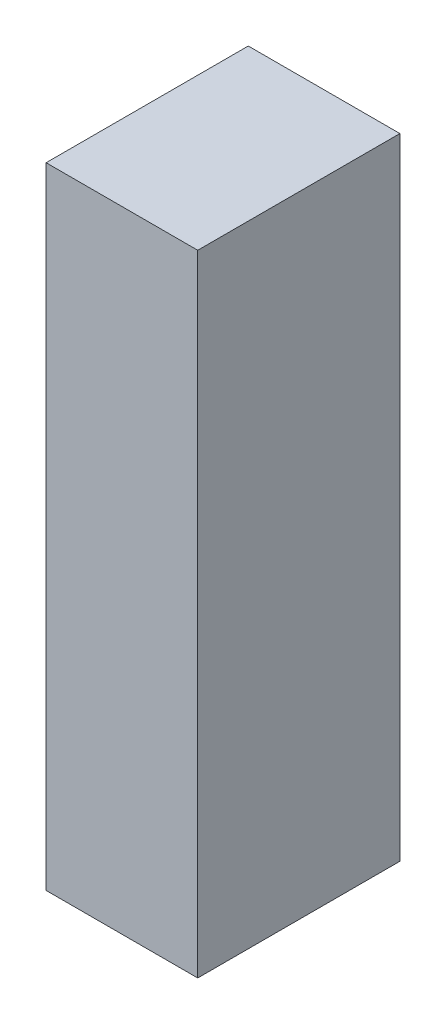
ISO-10303-21;
HEADER;
FILE_DESCRIPTION(('STEP AP214'),'2;1');
FILE_NAME('part.step','',(''),(''),'','','');
FILE_SCHEMA(('AUTOMOTIVE_DESIGN { 1 0 10303 214 1 1 1 1 }'));
ENDSEC;
DATA;
#1=APPLICATION_CONTEXT('core data for automotive mechanical design processes');
#2=APPLICATION_PROTOCOL_DEFINITION('international standard','automotive_design',2000,#1);
#3=PRODUCT_CONTEXT('',#1,'mechanical');
#4=PRODUCT('Part','Part','',(#3));
#5=PRODUCT_RELATED_PRODUCT_CATEGORY('part','',(#4));
#6=PRODUCT_DEFINITION_FORMATION('','',#4);
#7=PRODUCT_DEFINITION_CONTEXT('part definition',#1,'design');
#8=PRODUCT_DEFINITION('design','',#6,#7);
#9=PRODUCT_DEFINITION_SHAPE('','',#8);
#10=(LENGTH_UNIT() NAMED_UNIT(*) SI_UNIT(.MILLI.,.METRE.));
#11=(NAMED_UNIT(*) PLANE_ANGLE_UNIT() SI_UNIT($,.RADIAN.));
#12=(NAMED_UNIT(*) SI_UNIT($,.STERADIAN.) SOLID_ANGLE_UNIT());
#13=UNCERTAINTY_MEASURE_WITH_UNIT(LENGTH_MEASURE(1.E-05),#10,'distance_accuracy_value','');
#14=(GEOMETRIC_REPRESENTATION_CONTEXT(3) GLOBAL_UNCERTAINTY_ASSIGNED_CONTEXT((#13)) GLOBAL_UNIT_ASSIGNED_CONTEXT((#10,
#11,#12)) REPRESENTATION_CONTEXT('',''));
#15=CARTESIAN_POINT('',(0.,0.,0.));
#16=DIRECTION('',(0.,0.,1.));
#17=DIRECTION('',(1.,0.,0.));
#18=AXIS2_PLACEMENT_3D('',#15,#16,#17);
#19=CARTESIAN_POINT('',(0.,0.,34.));
#20=DIRECTION('',(1.,0.,0.));
#21=DIRECTION('',(0.,0.,-1.));
#22=AXIS2_PLACEMENT_3D('',#19,#20,#21);
#23=PLANE('',#22);
#24=DIRECTION('',(0.,-1.,0.));
#25=VECTOR('',#24,1.);
#26=CARTESIAN_POINT('',(0.,0.,0.));
#27=LINE('',#26,#25);
#28=CARTESIAN_POINT('',(0.,106.,0.));
#29=VERTEX_POINT('',#28);
#30=CARTESIAN_POINT('',(0.,0.,0.));
#31=VERTEX_POINT('',#30);
#32=EDGE_CURVE('E107',#29,#31,#27,.T.);
#33=ORIENTED_EDGE('',*,*,#32,.T.);
#34=DIRECTION('',(0.,0.,-1.));
#35=VECTOR('',#34,1.);
#36=CARTESIAN_POINT('',(0.,0.,34.));
#37=LINE('',#36,#35);
#38=CARTESIAN_POINT('',(0.,0.,34.));
#39=VERTEX_POINT('',#38);
#40=EDGE_CURVE('E11',#39,#31,#37,.T.);
#41=ORIENTED_EDGE('',*,*,#40,.F.);
#42=DIRECTION('',(0.,-1.,0.));
#43=VECTOR('',#42,1.);
#44=CARTESIAN_POINT('',(0.,0.,34.));
#45=LINE('',#44,#43);
#46=CARTESIAN_POINT('',(0.,106.,34.));
#47=VERTEX_POINT('',#46);
#48=EDGE_CURVE('E91',#47,#39,#45,.T.);
#49=ORIENTED_EDGE('',*,*,#48,.F.);
#50=DIRECTION('',(0.,0.,-1.));
#51=VECTOR('',#50,1.);
#52=CARTESIAN_POINT('',(0.,106.,34.));
#53=LINE('',#52,#51);
#54=EDGE_CURVE('E103',#47,#29,#53,.T.);
#55=ORIENTED_EDGE('',*,*,#54,.T.);
#56=EDGE_LOOP('',(#33,#41,#49,#55));
#57=FACE_BOUND('',#56,.T.);
#58=ADVANCED_FACE('F39',(#57),#23,.F.);
#59=CARTESIAN_POINT('',(0.,0.,34.));
#60=DIRECTION('',(0.,1.,0.));
#61=DIRECTION('',(0.,0.,1.));
#62=AXIS2_PLACEMENT_3D('',#59,#60,#61);
#63=PLANE('',#62);
#64=DIRECTION('',(1.,0.,0.));
#65=VECTOR('',#64,1.);
#66=CARTESIAN_POINT('',(0.,0.,0.));
#67=LINE('',#66,#65);
#68=CARTESIAN_POINT('',(25.5,0.,0.));
#69=VERTEX_POINT('',#68);
#70=EDGE_CURVE('E96',#31,#69,#67,.T.);
#71=ORIENTED_EDGE('',*,*,#70,.T.);
#72=DIRECTION('',(0.,0.,-1.));
#73=VECTOR('',#72,1.);
#74=CARTESIAN_POINT('',(25.5,0.,34.));
#75=LINE('',#74,#73);
#76=CARTESIAN_POINT('',(25.5,0.,34.));
#77=VERTEX_POINT('',#76);
#78=EDGE_CURVE('E48',#77,#69,#75,.T.);
#79=ORIENTED_EDGE('',*,*,#78,.F.);
#80=DIRECTION('',(1.,0.,0.));
#81=VECTOR('',#80,1.);
#82=CARTESIAN_POINT('',(0.,0.,34.));
#83=LINE('',#82,#81);
#84=EDGE_CURVE('E86',#39,#77,#83,.T.);
#85=ORIENTED_EDGE('',*,*,#84,.F.);
#86=ORIENTED_EDGE('',*,*,#40,.T.);
#87=EDGE_LOOP('',(#71,#79,#85,#86));
#88=FACE_BOUND('',#87,.T.);
#89=ADVANCED_FACE('F95',(#88),#63,.F.);
#90=CARTESIAN_POINT('',(25.5,0.,34.));
#91=DIRECTION('',(-1.,0.,0.));
#92=DIRECTION('',(0.,0.,1.));
#93=AXIS2_PLACEMENT_3D('',#90,#91,#92);
#94=PLANE('',#93);
#95=DIRECTION('',(0.,1.,0.));
#96=VECTOR('',#95,1.);
#97=CARTESIAN_POINT('',(25.5,0.,0.));
#98=LINE('',#97,#96);
#99=CARTESIAN_POINT('',(25.5,106.,0.));
#100=VERTEX_POINT('',#99);
#101=EDGE_CURVE('E73',#69,#100,#98,.T.);
#102=ORIENTED_EDGE('',*,*,#101,.T.);
#103=DIRECTION('',(0.,0.,-1.));
#104=VECTOR('',#103,1.);
#105=CARTESIAN_POINT('',(25.5,106.,34.));
#106=LINE('',#105,#104);
#107=CARTESIAN_POINT('',(25.5,106.,34.));
#108=VERTEX_POINT('',#107);
#109=EDGE_CURVE('E98',#108,#100,#106,.T.);
#110=ORIENTED_EDGE('',*,*,#109,.F.);
#111=DIRECTION('',(0.,1.,0.));
#112=VECTOR('',#111,1.);
#113=CARTESIAN_POINT('',(25.5,0.,34.));
#114=LINE('',#113,#112);
#115=EDGE_CURVE('E89',#77,#108,#114,.T.);
#116=ORIENTED_EDGE('',*,*,#115,.F.);
#117=ORIENTED_EDGE('',*,*,#78,.T.);
#118=EDGE_LOOP('',(#102,#110,#116,#117));
#119=FACE_BOUND('',#118,.T.);
#120=ADVANCED_FACE('F99',(#119),#94,.F.);
#121=CARTESIAN_POINT('',(0.,106.,34.));
#122=DIRECTION('',(0.,-1.,0.));
#123=DIRECTION('',(0.,0.,-1.));
#124=AXIS2_PLACEMENT_3D('',#121,#122,#123);
#125=PLANE('',#124);
#126=DIRECTION('',(-1.,0.,0.));
#127=VECTOR('',#126,1.);
#128=CARTESIAN_POINT('',(0.,106.,0.));
#129=LINE('',#128,#127);
#130=EDGE_CURVE('E79',#100,#29,#129,.T.);
#131=ORIENTED_EDGE('',*,*,#130,.T.);
#132=ORIENTED_EDGE('',*,*,#54,.F.);
#133=DIRECTION('',(-1.,0.,0.));
#134=VECTOR('',#133,1.);
#135=CARTESIAN_POINT('',(0.,106.,34.));
#136=LINE('',#135,#134);
#137=EDGE_CURVE('E56',#108,#47,#136,.T.);
#138=ORIENTED_EDGE('',*,*,#137,.F.);
#139=ORIENTED_EDGE('',*,*,#109,.T.);
#140=EDGE_LOOP('',(#131,#132,#138,#139));
#141=FACE_BOUND('',#140,.T.);
#142=ADVANCED_FACE('F120',(#141),#125,.F.);
#143=CARTESIAN_POINT('',(0.,0.,34.));
#144=DIRECTION('',(0.,0.,-1.));
#145=DIRECTION('',(-1.,0.,0.));
#146=AXIS2_PLACEMENT_3D('',#143,#144,#145);
#147=PLANE('',#146);
#148=ORIENTED_EDGE('',*,*,#48,.T.);
#149=ORIENTED_EDGE('',*,*,#84,.T.);
#150=ORIENTED_EDGE('',*,*,#115,.T.);
#151=ORIENTED_EDGE('',*,*,#137,.T.);
#152=EDGE_LOOP('',(#148,#149,#150,#151));
#153=FACE_BOUND('',#152,.T.);
#154=ADVANCED_FACE('F87',(#153),#147,.F.);
#155=CARTESIAN_POINT('',(0.,0.,0.));
#156=DIRECTION('',(0.,0.,-1.));
#157=DIRECTION('',(-1.,0.,0.));
#158=AXIS2_PLACEMENT_3D('',#155,#156,#157);
#159=PLANE('',#158);
#160=ORIENTED_EDGE('',*,*,#32,.F.);
#161=ORIENTED_EDGE('',*,*,#130,.F.);
#162=ORIENTED_EDGE('',*,*,#101,.F.);
#163=ORIENTED_EDGE('',*,*,#70,.F.);
#164=EDGE_LOOP('',(#160,#161,#162,#163));
#165=FACE_BOUND('',#164,.T.);
#166=ADVANCED_FACE('F123',(#165),#159,.T.);
#167=CLOSED_SHELL('',(#58,#89,#120,#142,#154,#166));
#168=MANIFOLD_SOLID_BREP('B2',#167);
#169=ADVANCED_BREP_SHAPE_REPRESENTATION('',(#18,#168),#14);
#170=SHAPE_DEFINITION_REPRESENTATION(#9,#169);
ENDSEC;
END-ISO-10303-21;
